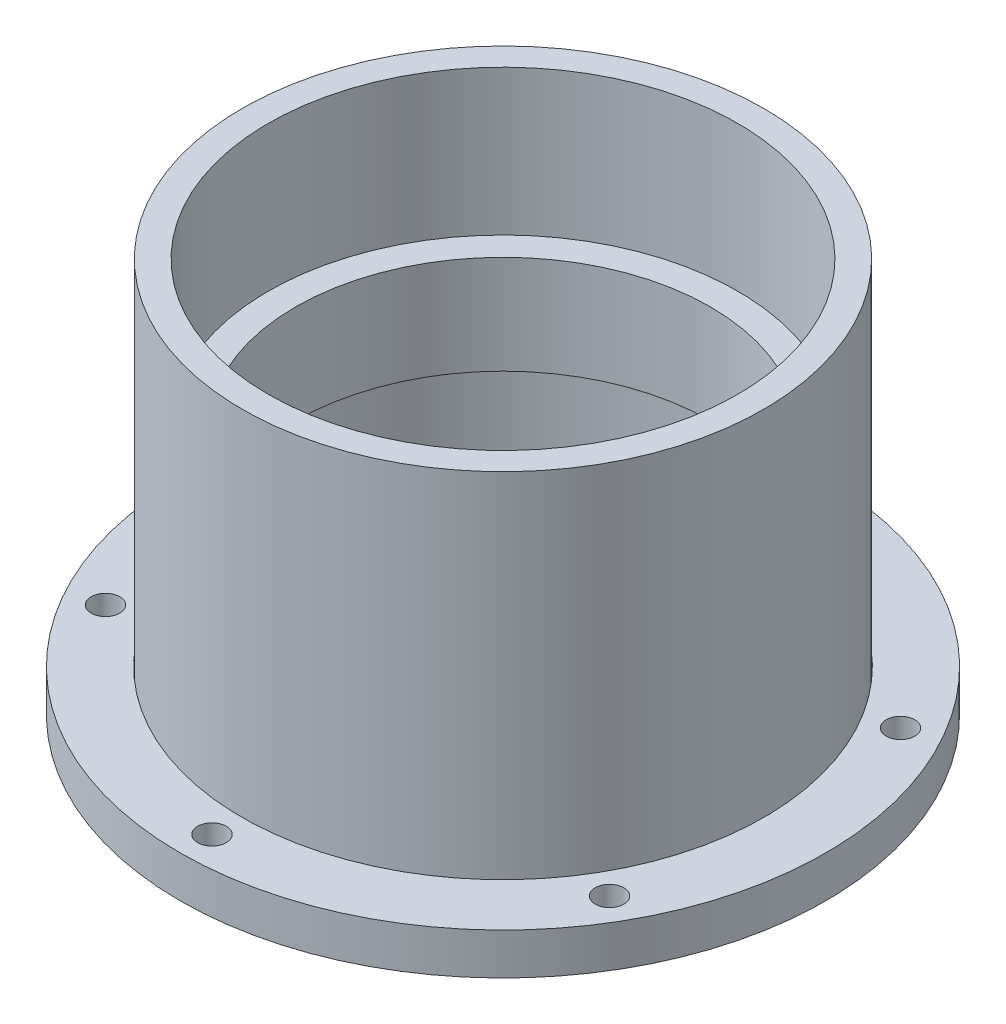
ISO-10303-21;
HEADER;
FILE_DESCRIPTION(('STEP AP214'),'2;1');
FILE_NAME('part.step','',(''),(''),'','','');
FILE_SCHEMA(('AUTOMOTIVE_DESIGN { 1 0 10303 214 1 1 1 1 }'));
ENDSEC;
DATA;
#1=APPLICATION_CONTEXT('core data for automotive mechanical design processes');
#2=APPLICATION_PROTOCOL_DEFINITION('international standard','automotive_design',2000,#1);
#3=PRODUCT_CONTEXT('',#1,'mechanical');
#4=PRODUCT('Part','Part','',(#3));
#5=PRODUCT_RELATED_PRODUCT_CATEGORY('part','',(#4));
#6=PRODUCT_DEFINITION_FORMATION('','',#4);
#7=PRODUCT_DEFINITION_CONTEXT('part definition',#1,'design');
#8=PRODUCT_DEFINITION('design','',#6,#7);
#9=PRODUCT_DEFINITION_SHAPE('','',#8);
#10=(LENGTH_UNIT() NAMED_UNIT(*) SI_UNIT(.MILLI.,.METRE.));
#11=(NAMED_UNIT(*) PLANE_ANGLE_UNIT() SI_UNIT($,.RADIAN.));
#12=(NAMED_UNIT(*) SI_UNIT($,.STERADIAN.) SOLID_ANGLE_UNIT());
#13=UNCERTAINTY_MEASURE_WITH_UNIT(LENGTH_MEASURE(1.E-05),#10,'distance_accuracy_value','');
#14=(GEOMETRIC_REPRESENTATION_CONTEXT(3) GLOBAL_UNCERTAINTY_ASSIGNED_CONTEXT((#13)) GLOBAL_UNIT_ASSIGNED_CONTEXT((#10,
#11,#12)) REPRESENTATION_CONTEXT('',''));
#15=CARTESIAN_POINT('',(0.,0.,0.));
#16=DIRECTION('',(0.,0.,1.));
#17=DIRECTION('',(1.,0.,0.));
#18=AXIS2_PLACEMENT_3D('',#15,#16,#17);
#19=CARTESIAN_POINT('',(0.,7.99999999999998,0.));
#20=DIRECTION('',(0.,-1.,0.));
#21=DIRECTION('',(0.,0.,-1.));
#22=AXIS2_PLACEMENT_3D('',#19,#20,#21);
#23=CYLINDRICAL_SURFACE('',#22,62.2);
#24=CARTESIAN_POINT('',(0.,7.99999999999998,0.));
#25=DIRECTION('',(0.,-1.,0.));
#26=DIRECTION('',(0.,0.,-1.));
#27=AXIS2_PLACEMENT_3D('',#24,#25,#26);
#28=CIRCLE('',#27,62.2);
#29=CARTESIAN_POINT('',(0.,7.99999999999998,-62.2));
#30=VERTEX_POINT('',#29);
#31=EDGE_CURVE('E11',#30,#30,#28,.T.);
#32=ORIENTED_EDGE('',*,*,#31,.T.);
#33=EDGE_LOOP('',(#32));
#34=FACE_BOUND('',#33,.T.);
#35=CARTESIAN_POINT('',(0.,0.,0.));
#36=DIRECTION('',(0.,-1.,0.));
#37=DIRECTION('',(0.,0.,-1.));
#38=AXIS2_PLACEMENT_3D('',#35,#36,#37);
#39=CIRCLE('',#38,62.2);
#40=CARTESIAN_POINT('',(0.,0.,-62.2));
#41=VERTEX_POINT('',#40);
#42=EDGE_CURVE('E50',#41,#41,#39,.T.);
#43=ORIENTED_EDGE('',*,*,#42,.F.);
#44=EDGE_LOOP('',(#43));
#45=FACE_BOUND('',#44,.T.);
#46=ADVANCED_FACE('F47',(#34,#45),#23,.T.);
#47=CARTESIAN_POINT('',(0.,7.99999999999998,0.));
#48=DIRECTION('',(0.,-1.,0.));
#49=DIRECTION('',(0.,0.,-1.));
#50=AXIS2_PLACEMENT_3D('',#47,#48,#49);
#51=PLANE('',#50);
#52=CARTESIAN_POINT('',(3.91464887711092E-13,7.99999999999998,-56.06));
#53=DIRECTION('',(0.,-1.,0.));
#54=DIRECTION('',(0.,0.,-1.));
#55=AXIS2_PLACEMENT_3D('',#52,#53,#54);
#56=CIRCLE('',#55,2.75);
#57=CARTESIAN_POINT('',(3.91464887711092E-13,7.99999999999998,-58.81));
#58=VERTEX_POINT('',#57);
#59=EDGE_CURVE('E92',#58,#58,#56,.T.);
#60=ORIENTED_EDGE('',*,*,#59,.T.);
#61=EDGE_LOOP('',(#60));
#62=FACE_BOUND('',#61,.T.);
#63=CARTESIAN_POINT('',(48.5493841361559,7.99999999999998,-28.0299999999995));
#64=DIRECTION('',(0.,-1.,0.));
#65=DIRECTION('',(0.,0.,-1.));
#66=AXIS2_PLACEMENT_3D('',#63,#64,#65);
#67=CIRCLE('',#66,2.75);
#68=CARTESIAN_POINT('',(48.5493841361559,7.99999999999998,-30.7799999999995));
#69=VERTEX_POINT('',#68);
#70=EDGE_CURVE('E86',#69,#69,#67,.T.);
#71=ORIENTED_EDGE('',*,*,#70,.T.);
#72=EDGE_LOOP('',(#71));
#73=FACE_BOUND('',#72,.T.);
#74=CARTESIAN_POINT('',(48.5493841361553,7.99999999999998,28.0300000000006));
#75=DIRECTION('',(0.,-1.,0.));
#76=DIRECTION('',(0.,0.,-1.));
#77=AXIS2_PLACEMENT_3D('',#74,#75,#76);
#78=CIRCLE('',#77,2.75);
#79=CARTESIAN_POINT('',(48.5493841361553,7.99999999999998,25.2800000000006));
#80=VERTEX_POINT('',#79);
#81=EDGE_CURVE('E80',#80,#80,#78,.T.);
#82=ORIENTED_EDGE('',*,*,#81,.T.);
#83=EDGE_LOOP('',(#82));
#84=FACE_BOUND('',#83,.T.);
#85=CARTESIAN_POINT('',(-48.5493841361555,7.99999999999998,-28.0300000000002));
#86=DIRECTION('',(0.,-1.,0.));
#87=DIRECTION('',(0.,0.,-1.));
#88=AXIS2_PLACEMENT_3D('',#85,#86,#87);
#89=CIRCLE('',#88,2.75);
#90=CARTESIAN_POINT('',(-48.5493841361555,7.99999999999998,-30.7800000000002));
#91=VERTEX_POINT('',#90);
#92=EDGE_CURVE('E74',#91,#91,#89,.T.);
#93=ORIENTED_EDGE('',*,*,#92,.T.);
#94=EDGE_LOOP('',(#93));
#95=FACE_BOUND('',#94,.T.);
#96=CARTESIAN_POINT('',(-48.5493841361557,7.99999999999998,28.0299999999999));
#97=DIRECTION('',(0.,-1.,0.));
#98=DIRECTION('',(0.,0.,-1.));
#99=AXIS2_PLACEMENT_3D('',#96,#97,#98);
#100=CIRCLE('',#99,2.75);
#101=CARTESIAN_POINT('',(-48.5493841361557,7.99999999999998,25.2799999999999));
#102=VERTEX_POINT('',#101);
#103=EDGE_CURVE('E68',#102,#102,#100,.T.);
#104=ORIENTED_EDGE('',*,*,#103,.T.);
#105=EDGE_LOOP('',(#104));
#106=FACE_BOUND('',#105,.T.);
#107=CARTESIAN_POINT('',(0.,7.99999999999998,56.06));
#108=DIRECTION('',(0.,-1.,0.));
#109=DIRECTION('',(0.,0.,-1.));
#110=AXIS2_PLACEMENT_3D('',#107,#108,#109);
#111=CIRCLE('',#110,2.75);
#112=CARTESIAN_POINT('',(0.,7.99999999999998,53.31));
#113=VERTEX_POINT('',#112);
#114=EDGE_CURVE('E62',#113,#113,#111,.T.);
#115=ORIENTED_EDGE('',*,*,#114,.T.);
#116=EDGE_LOOP('',(#115));
#117=FACE_BOUND('',#116,.T.);
#118=CARTESIAN_POINT('',(0.,7.99999999999998,0.));
#119=DIRECTION('',(0.,-1.,0.));
#120=DIRECTION('',(0.,0.,-1.));
#121=AXIS2_PLACEMENT_3D('',#118,#119,#120);
#122=CIRCLE('',#121,50.32);
#123=CARTESIAN_POINT('',(0.,7.99999999999998,-50.32));
#124=VERTEX_POINT('',#123);
#125=EDGE_CURVE('E57',#124,#124,#122,.T.);
#126=ORIENTED_EDGE('',*,*,#125,.T.);
#127=EDGE_LOOP('',(#126));
#128=FACE_BOUND('',#127,.T.);
#129=ORIENTED_EDGE('',*,*,#31,.F.);
#130=EDGE_LOOP('',(#129));
#131=FACE_BOUND('',#130,.T.);
#132=ADVANCED_FACE('F101',(#62,#73,#84,#95,#106,#117,#128,#131),#51,.F.);
#133=CARTESIAN_POINT('',(0.,0.,0.));
#134=DIRECTION('',(0.,-1.,0.));
#135=DIRECTION('',(0.,0.,-1.));
#136=AXIS2_PLACEMENT_3D('',#133,#134,#135);
#137=PLANE('',#136);
#138=CARTESIAN_POINT('',(3.91464887711092E-13,0.,-56.06));
#139=DIRECTION('',(0.,-1.,0.));
#140=DIRECTION('',(0.,0.,-1.));
#141=AXIS2_PLACEMENT_3D('',#138,#139,#140);
#142=CIRCLE('',#141,2.75);
#143=CARTESIAN_POINT('',(3.91464887711092E-13,0.,-58.81));
#144=VERTEX_POINT('',#143);
#145=EDGE_CURVE('E95',#144,#144,#142,.T.);
#146=ORIENTED_EDGE('',*,*,#145,.F.);
#147=EDGE_LOOP('',(#146));
#148=FACE_BOUND('',#147,.T.);
#149=CARTESIAN_POINT('',(48.5493841361559,0.,-28.0299999999995));
#150=DIRECTION('',(0.,-1.,0.));
#151=DIRECTION('',(0.,0.,-1.));
#152=AXIS2_PLACEMENT_3D('',#149,#150,#151);
#153=CIRCLE('',#152,2.75);
#154=CARTESIAN_POINT('',(48.5493841361559,0.,-30.7799999999995));
#155=VERTEX_POINT('',#154);
#156=EDGE_CURVE('E89',#155,#155,#153,.T.);
#157=ORIENTED_EDGE('',*,*,#156,.F.);
#158=EDGE_LOOP('',(#157));
#159=FACE_BOUND('',#158,.T.);
#160=CARTESIAN_POINT('',(48.5493841361553,0.,28.0300000000006));
#161=DIRECTION('',(0.,-1.,0.));
#162=DIRECTION('',(0.,0.,-1.));
#163=AXIS2_PLACEMENT_3D('',#160,#161,#162);
#164=CIRCLE('',#163,2.75);
#165=CARTESIAN_POINT('',(48.5493841361553,0.,25.2800000000006));
#166=VERTEX_POINT('',#165);
#167=EDGE_CURVE('E83',#166,#166,#164,.T.);
#168=ORIENTED_EDGE('',*,*,#167,.F.);
#169=EDGE_LOOP('',(#168));
#170=FACE_BOUND('',#169,.T.);
#171=CARTESIAN_POINT('',(-48.5493841361555,0.,-28.0300000000002));
#172=DIRECTION('',(0.,-1.,0.));
#173=DIRECTION('',(0.,0.,-1.));
#174=AXIS2_PLACEMENT_3D('',#171,#172,#173);
#175=CIRCLE('',#174,2.75);
#176=CARTESIAN_POINT('',(-48.5493841361555,0.,-30.7800000000002));
#177=VERTEX_POINT('',#176);
#178=EDGE_CURVE('E77',#177,#177,#175,.T.);
#179=ORIENTED_EDGE('',*,*,#178,.F.);
#180=EDGE_LOOP('',(#179));
#181=FACE_BOUND('',#180,.T.);
#182=CARTESIAN_POINT('',(-48.5493841361557,0.,28.0299999999999));
#183=DIRECTION('',(0.,-1.,0.));
#184=DIRECTION('',(0.,0.,-1.));
#185=AXIS2_PLACEMENT_3D('',#182,#183,#184);
#186=CIRCLE('',#185,2.75);
#187=CARTESIAN_POINT('',(-48.5493841361557,0.,25.2799999999999));
#188=VERTEX_POINT('',#187);
#189=EDGE_CURVE('E71',#188,#188,#186,.T.);
#190=ORIENTED_EDGE('',*,*,#189,.F.);
#191=EDGE_LOOP('',(#190));
#192=FACE_BOUND('',#191,.T.);
#193=CARTESIAN_POINT('',(0.,0.,56.06));
#194=DIRECTION('',(0.,-1.,0.));
#195=DIRECTION('',(0.,0.,-1.));
#196=AXIS2_PLACEMENT_3D('',#193,#194,#195);
#197=CIRCLE('',#196,2.75);
#198=CARTESIAN_POINT('',(0.,0.,53.31));
#199=VERTEX_POINT('',#198);
#200=EDGE_CURVE('E65',#199,#199,#197,.T.);
#201=ORIENTED_EDGE('',*,*,#200,.F.);
#202=EDGE_LOOP('',(#201));
#203=FACE_BOUND('',#202,.T.);
#204=CARTESIAN_POINT('',(0.,0.,0.));
#205=DIRECTION('',(0.,-1.,0.));
#206=DIRECTION('',(0.,0.,-1.));
#207=AXIS2_PLACEMENT_3D('',#204,#205,#206);
#208=CIRCLE('',#207,50.32);
#209=CARTESIAN_POINT('',(0.,0.,-50.32));
#210=VERTEX_POINT('',#209);
#211=EDGE_CURVE('E59',#210,#210,#208,.T.);
#212=ORIENTED_EDGE('',*,*,#211,.F.);
#213=EDGE_LOOP('',(#212));
#214=FACE_BOUND('',#213,.T.);
#215=ORIENTED_EDGE('',*,*,#42,.T.);
#216=EDGE_LOOP('',(#215));
#217=FACE_BOUND('',#216,.T.);
#218=ADVANCED_FACE('F111',(#148,#159,#170,#181,#192,#203,#214,#217),#137,.T.);
#219=CARTESIAN_POINT('',(0.,7.99999999999998,0.));
#220=DIRECTION('',(0.,-1.,0.));
#221=DIRECTION('',(0.,0.,-1.));
#222=AXIS2_PLACEMENT_3D('',#219,#220,#221);
#223=CYLINDRICAL_SURFACE('',#222,50.32);
#224=ORIENTED_EDGE('',*,*,#125,.F.);
#225=EDGE_LOOP('',(#224));
#226=FACE_BOUND('',#225,.T.);
#227=ORIENTED_EDGE('',*,*,#211,.T.);
#228=EDGE_LOOP('',(#227));
#229=FACE_BOUND('',#228,.T.);
#230=ADVANCED_FACE('F114',(#226,#229),#223,.F.);
#231=CARTESIAN_POINT('',(0.,7.99999999999998,56.06));
#232=DIRECTION('',(0.,-1.,0.));
#233=DIRECTION('',(0.,0.,-1.));
#234=AXIS2_PLACEMENT_3D('',#231,#232,#233);
#235=CYLINDRICAL_SURFACE('',#234,2.75);
#236=ORIENTED_EDGE('',*,*,#114,.F.);
#237=EDGE_LOOP('',(#236));
#238=FACE_BOUND('',#237,.T.);
#239=ORIENTED_EDGE('',*,*,#200,.T.);
#240=EDGE_LOOP('',(#239));
#241=FACE_BOUND('',#240,.T.);
#242=ADVANCED_FACE('F139',(#238,#241),#235,.F.);
#243=CARTESIAN_POINT('',(-48.5493841361557,7.99999999999998,28.0299999999999));
#244=DIRECTION('',(0.,-1.,0.));
#245=DIRECTION('',(0.,0.,-1.));
#246=AXIS2_PLACEMENT_3D('',#243,#244,#245);
#247=CYLINDRICAL_SURFACE('',#246,2.75);
#248=ORIENTED_EDGE('',*,*,#103,.F.);
#249=EDGE_LOOP('',(#248));
#250=FACE_BOUND('',#249,.T.);
#251=ORIENTED_EDGE('',*,*,#189,.T.);
#252=EDGE_LOOP('',(#251));
#253=FACE_BOUND('',#252,.T.);
#254=ADVANCED_FACE('F143',(#250,#253),#247,.F.);
#255=CARTESIAN_POINT('',(-48.5493841361555,7.99999999999998,-28.0300000000002));
#256=DIRECTION('',(0.,-1.,0.));
#257=DIRECTION('',(0.,0.,-1.));
#258=AXIS2_PLACEMENT_3D('',#255,#256,#257);
#259=CYLINDRICAL_SURFACE('',#258,2.75);
#260=ORIENTED_EDGE('',*,*,#92,.F.);
#261=EDGE_LOOP('',(#260));
#262=FACE_BOUND('',#261,.T.);
#263=ORIENTED_EDGE('',*,*,#178,.T.);
#264=EDGE_LOOP('',(#263));
#265=FACE_BOUND('',#264,.T.);
#266=ADVANCED_FACE('F147',(#262,#265),#259,.F.);
#267=CARTESIAN_POINT('',(48.5493841361553,7.99999999999998,28.0300000000006));
#268=DIRECTION('',(0.,-1.,0.));
#269=DIRECTION('',(0.,0.,-1.));
#270=AXIS2_PLACEMENT_3D('',#267,#268,#269);
#271=CYLINDRICAL_SURFACE('',#270,2.75);
#272=ORIENTED_EDGE('',*,*,#81,.F.);
#273=EDGE_LOOP('',(#272));
#274=FACE_BOUND('',#273,.T.);
#275=ORIENTED_EDGE('',*,*,#167,.T.);
#276=EDGE_LOOP('',(#275));
#277=FACE_BOUND('',#276,.T.);
#278=ADVANCED_FACE('F151',(#274,#277),#271,.F.);
#279=CARTESIAN_POINT('',(48.5493841361559,7.99999999999998,-28.0299999999995));
#280=DIRECTION('',(0.,-1.,0.));
#281=DIRECTION('',(0.,0.,-1.));
#282=AXIS2_PLACEMENT_3D('',#279,#280,#281);
#283=CYLINDRICAL_SURFACE('',#282,2.75);
#284=ORIENTED_EDGE('',*,*,#70,.F.);
#285=EDGE_LOOP('',(#284));
#286=FACE_BOUND('',#285,.T.);
#287=ORIENTED_EDGE('',*,*,#156,.T.);
#288=EDGE_LOOP('',(#287));
#289=FACE_BOUND('',#288,.T.);
#290=ADVANCED_FACE('F107',(#286,#289),#283,.F.);
#291=CARTESIAN_POINT('',(3.91464887711092E-13,7.99999999999998,-56.06));
#292=DIRECTION('',(0.,-1.,0.));
#293=DIRECTION('',(0.,0.,-1.));
#294=AXIS2_PLACEMENT_3D('',#291,#292,#293);
#295=CYLINDRICAL_SURFACE('',#294,2.75);
#296=ORIENTED_EDGE('',*,*,#59,.F.);
#297=EDGE_LOOP('',(#296));
#298=FACE_BOUND('',#297,.T.);
#299=ORIENTED_EDGE('',*,*,#145,.T.);
#300=EDGE_LOOP('',(#299));
#301=FACE_BOUND('',#300,.T.);
#302=ADVANCED_FACE('F104',(#298,#301),#295,.F.);
#303=CLOSED_SHELL('',(#46,#132,#218,#230,#242,#254,#266,#278,#290,#302));
#304=MANIFOLD_SOLID_BREP('B2',#303);
#305=CARTESIAN_POINT('',(0.,48.,0.));
#306=DIRECTION('',(0.,1.,0.));
#307=DIRECTION('',(0.,0.,1.));
#308=AXIS2_PLACEMENT_3D('',#305,#306,#307);
#309=PLANE('',#308);
#310=CARTESIAN_POINT('',(0.,48.,0.));
#311=DIRECTION('',(0.,1.,0.));
#312=DIRECTION('',(0.,0.,1.));
#313=AXIS2_PLACEMENT_3D('',#310,#311,#312);
#314=CIRCLE('',#313,39.97);
#315=CARTESIAN_POINT('',(0.,48.,39.97));
#316=VERTEX_POINT('',#315);
#317=EDGE_CURVE('E250',#316,#316,#314,.T.);
#318=ORIENTED_EDGE('',*,*,#317,.F.);
#319=EDGE_LOOP('',(#318));
#320=FACE_BOUND('',#319,.T.);
#321=CARTESIAN_POINT('',(0.,48.,0.));
#322=DIRECTION('',(0.,1.,0.));
#323=DIRECTION('',(0.,0.,1.));
#324=AXIS2_PLACEMENT_3D('',#321,#322,#323);
#325=CIRCLE('',#324,45.22);
#326=CARTESIAN_POINT('',(0.,48.,45.22));
#327=VERTEX_POINT('',#326);
#328=EDGE_CURVE('E262',#327,#327,#325,.T.);
#329=ORIENTED_EDGE('',*,*,#328,.T.);
#330=EDGE_LOOP('',(#329));
#331=FACE_BOUND('',#330,.T.);
#332=ADVANCED_FACE('F235',(#320,#331),#309,.T.);
#333=CARTESIAN_POINT('',(0.,0.,0.));
#334=DIRECTION('',(0.,1.,0.));
#335=DIRECTION('',(0.,0.,1.));
#336=AXIS2_PLACEMENT_3D('',#333,#334,#335);
#337=PLANE('',#336);
#338=CARTESIAN_POINT('',(0.,0.,0.));
#339=DIRECTION('',(0.,1.,0.));
#340=DIRECTION('',(0.,0.,1.));
#341=AXIS2_PLACEMENT_3D('',#338,#339,#340);
#342=CIRCLE('',#341,50.22);
#343=CARTESIAN_POINT('',(0.,0.,-50.22));
#344=VERTEX_POINT('',#343);
#345=EDGE_CURVE('E46',#344,#344,#342,.T.);
#346=ORIENTED_EDGE('',*,*,#345,.F.);
#347=EDGE_LOOP('',(#346));
#348=FACE_BOUND('',#347,.T.);
#349=CARTESIAN_POINT('',(0.,0.,0.));
#350=DIRECTION('',(0.,1.,0.));
#351=DIRECTION('',(0.,0.,1.));
#352=AXIS2_PLACEMENT_3D('',#349,#350,#351);
#353=CIRCLE('',#352,45.22);
#354=CARTESIAN_POINT('',(0.,0.,-45.22));
#355=VERTEX_POINT('',#354);
#356=EDGE_CURVE('E242',#355,#355,#353,.T.);
#357=ORIENTED_EDGE('',*,*,#356,.T.);
#358=EDGE_LOOP('',(#357));
#359=FACE_BOUND('',#358,.T.);
#360=ADVANCED_FACE('F287',(#348,#359),#337,.F.);
#361=CARTESIAN_POINT('',(0.,29.,0.));
#362=DIRECTION('',(0.,-1.,0.));
#363=DIRECTION('',(0.,0.,-1.));
#364=AXIS2_PLACEMENT_3D('',#361,#362,#363);
#365=CYLINDRICAL_SURFACE('',#364,50.22);
#366=CARTESIAN_POINT('',(0.,76.,0.));
#367=DIRECTION('',(0.,1.,0.));
#368=DIRECTION('',(0.,0.,1.));
#369=AXIS2_PLACEMENT_3D('',#366,#367,#368);
#370=CIRCLE('',#369,50.22);
#371=CARTESIAN_POINT('',(0.,76.,-50.22));
#372=VERTEX_POINT('',#371);
#373=EDGE_CURVE('E256',#372,#372,#370,.T.);
#374=CARTESIAN_POINT('',(0.,0.,-50.22));
#375=CARTESIAN_POINT('',(0.,0.791666666666669,-50.22));
#376=CARTESIAN_POINT('',(0.,1.58333333333334,-50.22));
#377=CARTESIAN_POINT('',(0.,3.16666666666667,-50.22));
#378=CARTESIAN_POINT('',(0.,3.95833333333333,-50.22));
#379=CARTESIAN_POINT('',(0.,5.54166666666667,-50.22));
#380=CARTESIAN_POINT('',(0.,6.33333333333333,-50.22));
#381=CARTESIAN_POINT('',(0.,7.91666666666667,-50.22));
#382=CARTESIAN_POINT('',(0.,8.70833333333333,-50.22));
#383=CARTESIAN_POINT('',(0.,10.2916666666667,-50.22));
#384=CARTESIAN_POINT('',(0.,11.0833333333333,-50.22));
#385=CARTESIAN_POINT('',(0.,12.6666666666667,-50.22));
#386=CARTESIAN_POINT('',(0.,13.4583333333333,-50.22));
#387=CARTESIAN_POINT('',(0.,15.0416666666667,-50.22));
#388=CARTESIAN_POINT('',(0.,15.8333333333333,-50.22));
#389=CARTESIAN_POINT('',(0.,17.4166666666667,-50.22));
#390=CARTESIAN_POINT('',(0.,18.2083333333333,-50.22));
#391=CARTESIAN_POINT('',(0.,19.7916666666667,-50.22));
#392=CARTESIAN_POINT('',(0.,20.5833333333333,-50.22));
#393=CARTESIAN_POINT('',(0.,22.1666666666667,-50.22));
#394=CARTESIAN_POINT('',(0.,22.9583333333333,-50.22));
#395=CARTESIAN_POINT('',(0.,24.5416666666667,-50.22));
#396=CARTESIAN_POINT('',(0.,25.3333333333333,-50.22));
#397=CARTESIAN_POINT('',(0.,26.9166666666667,-50.22));
#398=CARTESIAN_POINT('',(0.,27.7083333333333,-50.22));
#399=CARTESIAN_POINT('',(0.,29.2916666666667,-50.22));
#400=CARTESIAN_POINT('',(0.,30.0833333333333,-50.22));
#401=CARTESIAN_POINT('',(0.,31.6666666666667,-50.22));
#402=CARTESIAN_POINT('',(0.,32.4583333333333,-50.22));
#403=CARTESIAN_POINT('',(0.,34.0416666666667,-50.22));
#404=CARTESIAN_POINT('',(0.,34.8333333333333,-50.22));
#405=CARTESIAN_POINT('',(0.,36.4166666666667,-50.22));
#406=CARTESIAN_POINT('',(0.,37.2083333333333,-50.22));
#407=CARTESIAN_POINT('',(0.,38.7916666666667,-50.22));
#408=CARTESIAN_POINT('',(0.,39.5833333333333,-50.22));
#409=CARTESIAN_POINT('',(0.,41.1666666666667,-50.22));
#410=CARTESIAN_POINT('',(0.,41.9583333333333,-50.22));
#411=CARTESIAN_POINT('',(0.,43.5416666666667,-50.22));
#412=CARTESIAN_POINT('',(0.,44.3333333333333,-50.22));
#413=CARTESIAN_POINT('',(0.,45.9166666666667,-50.22));
#414=CARTESIAN_POINT('',(0.,46.7083333333333,-50.22));
#415=CARTESIAN_POINT('',(0.,48.2916666666667,-50.22));
#416=CARTESIAN_POINT('',(0.,49.0833333333333,-50.22));
#417=CARTESIAN_POINT('',(0.,50.6666666666667,-50.22));
#418=CARTESIAN_POINT('',(0.,51.4583333333333,-50.22));
#419=CARTESIAN_POINT('',(0.,53.0416666666667,-50.22));
#420=CARTESIAN_POINT('',(0.,53.8333333333333,-50.22));
#421=CARTESIAN_POINT('',(0.,55.4166666666667,-50.22));
#422=CARTESIAN_POINT('',(0.,56.2083333333333,-50.22));
#423=CARTESIAN_POINT('',(0.,57.7916666666667,-50.22));
#424=CARTESIAN_POINT('',(0.,58.5833333333333,-50.22));
#425=CARTESIAN_POINT('',(0.,60.1666666666667,-50.22));
#426=CARTESIAN_POINT('',(0.,60.9583333333333,-50.22));
#427=CARTESIAN_POINT('',(0.,62.5416666666667,-50.22));
#428=CARTESIAN_POINT('',(0.,63.3333333333333,-50.22));
#429=CARTESIAN_POINT('',(0.,64.9166666666667,-50.22));
#430=CARTESIAN_POINT('',(0.,65.7083333333333,-50.22));
#431=CARTESIAN_POINT('',(0.,67.2916666666667,-50.22));
#432=CARTESIAN_POINT('',(0.,68.0833333333333,-50.22));
#433=CARTESIAN_POINT('',(0.,69.6666666666667,-50.22));
#434=CARTESIAN_POINT('',(0.,70.4583333333333,-50.22));
#435=CARTESIAN_POINT('',(0.,72.0416666666667,-50.22));
#436=CARTESIAN_POINT('',(0.,72.8333333333333,-50.22));
#437=CARTESIAN_POINT('',(0.,74.4166666666667,-50.22));
#438=CARTESIAN_POINT('',(0.,75.2083333333333,-50.22));
#439=CARTESIAN_POINT('',(0.,76.,-50.22));
#440=B_SPLINE_CURVE_WITH_KNOTS('',3,(#374,#375,#376,#377,#378,#379,#380,#381,#382,#383,#384,
#385,#386,#387,#388,#389,#390,#391,#392,#393,#394,#395,#396,#397,#398,#399,#400,#401,#402,#403,
#404,#405,#406,#407,#408,#409,#410,#411,#412,#413,#414,#415,#416,#417,#418,#419,#420,#421,#422,
#423,#424,#425,#426,#427,#428,#429,#430,#431,#432,#433,#434,#435,#436,#437,#438,#439),
.UNSPECIFIED.,.F.,.F.,(4,2,2,2,2,2,2,2,2,2,2,2,2,2,2,2,2,2,2,2,2,2,2,2,2,2,2,2,2,2,2,2,4),(0.,
2.375,4.75,7.125,9.5,11.875,14.25,16.625,19.,21.375,23.75,26.125,28.5,30.875,33.25,35.625,38.,
40.375,42.75,45.125,47.5,49.875,52.25,54.625,57.,59.375,61.75,64.125,66.5,68.875,71.25,73.625,
76.),.UNSPECIFIED.);
#441=EDGE_CURVE('BSEAM237',#344,#372,#440,.T.);
#442=ORIENTED_EDGE('',*,*,#345,.T.);
#443=ORIENTED_EDGE('',*,*,#373,.F.);
#444=ORIENTED_EDGE('',*,*,#441,.T.);
#445=ORIENTED_EDGE('',*,*,#441,.F.);
#446=EDGE_LOOP('',(#442,#444,#443,#445));
#447=FACE_BOUND('',#446,.T.);
#448=ADVANCED_FACE('F237',(#447),#365,.T.);
#449=CARTESIAN_POINT('',(0.,29.,0.));
#450=DIRECTION('',(0.,-1.,0.));
#451=DIRECTION('',(0.,0.,-1.));
#452=AXIS2_PLACEMENT_3D('',#449,#450,#451);
#453=CYLINDRICAL_SURFACE('',#452,45.22);
#454=CARTESIAN_POINT('',(0.,29.,0.));
#455=DIRECTION('',(0.,1.,0.));
#456=DIRECTION('',(0.,0.,1.));
#457=AXIS2_PLACEMENT_3D('',#454,#455,#456);
#458=CIRCLE('',#457,45.22);
#459=CARTESIAN_POINT('',(0.,29.,-45.22));
#460=VERTEX_POINT('',#459);
#461=EDGE_CURVE('E246',#460,#460,#458,.T.);
#462=CARTESIAN_POINT('',(0.,29.,-45.22));
#463=CARTESIAN_POINT('',(0.,28.6979166666667,-45.22));
#464=CARTESIAN_POINT('',(0.,28.3958333333333,-45.22));
#465=CARTESIAN_POINT('',(0.,27.7916666666667,-45.22));
#466=CARTESIAN_POINT('',(0.,27.4895833333333,-45.22));
#467=CARTESIAN_POINT('',(0.,26.8854166666667,-45.22));
#468=CARTESIAN_POINT('',(0.,26.5833333333333,-45.22));
#469=CARTESIAN_POINT('',(0.,25.9791666666667,-45.22));
#470=CARTESIAN_POINT('',(0.,25.6770833333333,-45.22));
#471=CARTESIAN_POINT('',(0.,25.0729166666667,-45.22));
#472=CARTESIAN_POINT('',(0.,24.7708333333333,-45.22));
#473=CARTESIAN_POINT('',(0.,24.1666666666667,-45.22));
#474=CARTESIAN_POINT('',(0.,23.8645833333333,-45.22));
#475=CARTESIAN_POINT('',(0.,23.2604166666667,-45.22));
#476=CARTESIAN_POINT('',(0.,22.9583333333333,-45.22));
#477=CARTESIAN_POINT('',(0.,22.3541666666667,-45.22));
#478=CARTESIAN_POINT('',(0.,22.0520833333333,-45.22));
#479=CARTESIAN_POINT('',(0.,21.4479166666667,-45.22));
#480=CARTESIAN_POINT('',(0.,21.1458333333333,-45.22));
#481=CARTESIAN_POINT('',(0.,20.5416666666667,-45.22));
#482=CARTESIAN_POINT('',(0.,20.2395833333333,-45.22));
#483=CARTESIAN_POINT('',(0.,19.6354166666667,-45.22));
#484=CARTESIAN_POINT('',(0.,19.3333333333333,-45.22));
#485=CARTESIAN_POINT('',(0.,18.7291666666667,-45.22));
#486=CARTESIAN_POINT('',(0.,18.4270833333333,-45.22));
#487=CARTESIAN_POINT('',(0.,17.8229166666667,-45.22));
#488=CARTESIAN_POINT('',(0.,17.5208333333333,-45.22));
#489=CARTESIAN_POINT('',(0.,16.9166666666667,-45.22));
#490=CARTESIAN_POINT('',(0.,16.6145833333333,-45.22));
#491=CARTESIAN_POINT('',(0.,16.0104166666667,-45.22));
#492=CARTESIAN_POINT('',(0.,15.7083333333333,-45.22));
#493=CARTESIAN_POINT('',(0.,15.1041666666667,-45.22));
#494=CARTESIAN_POINT('',(0.,14.8020833333333,-45.22));
#495=CARTESIAN_POINT('',(0.,14.1979166666667,-45.22));
#496=CARTESIAN_POINT('',(0.,13.8958333333333,-45.22));
#497=CARTESIAN_POINT('',(0.,13.2916666666667,-45.22));
#498=CARTESIAN_POINT('',(0.,12.9895833333333,-45.22));
#499=CARTESIAN_POINT('',(0.,12.3854166666667,-45.22));
#500=CARTESIAN_POINT('',(0.,12.0833333333333,-45.22));
#501=CARTESIAN_POINT('',(0.,11.4791666666667,-45.22));
#502=CARTESIAN_POINT('',(0.,11.1770833333333,-45.22));
#503=CARTESIAN_POINT('',(0.,10.5729166666667,-45.22));
#504=CARTESIAN_POINT('',(0.,10.2708333333333,-45.22));
#505=CARTESIAN_POINT('',(0.,9.66666666666667,-45.22));
#506=CARTESIAN_POINT('',(0.,9.36458333333333,-45.22));
#507=CARTESIAN_POINT('',(0.,8.76041666666667,-45.22));
#508=CARTESIAN_POINT('',(0.,8.45833333333333,-45.22));
#509=CARTESIAN_POINT('',(0.,7.85416666666667,-45.22));
#510=CARTESIAN_POINT('',(0.,7.55208333333333,-45.22));
#511=CARTESIAN_POINT('',(0.,6.94791666666667,-45.22));
#512=CARTESIAN_POINT('',(0.,6.64583333333333,-45.22));
#513=CARTESIAN_POINT('',(0.,6.04166666666667,-45.22));
#514=CARTESIAN_POINT('',(0.,5.73958333333333,-45.22));
#515=CARTESIAN_POINT('',(0.,5.13541666666667,-45.22));
#516=CARTESIAN_POINT('',(0.,4.83333333333333,-45.22));
#517=CARTESIAN_POINT('',(0.,4.22916666666667,-45.22));
#518=CARTESIAN_POINT('',(0.,3.92708333333333,-45.22));
#519=CARTESIAN_POINT('',(0.,3.32291666666667,-45.22));
#520=CARTESIAN_POINT('',(0.,3.02083333333333,-45.22));
#521=CARTESIAN_POINT('',(0.,2.41666666666667,-45.22));
#522=CARTESIAN_POINT('',(0.,2.11458333333333,-45.22));
#523=CARTESIAN_POINT('',(0.,1.51041666666667,-45.22));
#524=CARTESIAN_POINT('',(0.,1.20833333333333,-45.22));
#525=CARTESIAN_POINT('',(0.,0.604166666666667,-45.22));
#526=CARTESIAN_POINT('',(0.,0.302083333333333,-45.22));
#527=CARTESIAN_POINT('',(0.,0.,-45.22));
#528=B_SPLINE_CURVE_WITH_KNOTS('',3,(#462,#463,#464,#465,#466,#467,#468,#469,#470,#471,#472,
#473,#474,#475,#476,#477,#478,#479,#480,#481,#482,#483,#484,#485,#486,#487,#488,#489,#490,#491,
#492,#493,#494,#495,#496,#497,#498,#499,#500,#501,#502,#503,#504,#505,#506,#507,#508,#509,#510,
#511,#512,#513,#514,#515,#516,#517,#518,#519,#520,#521,#522,#523,#524,#525,#526,#527),
.UNSPECIFIED.,.F.,.F.,(4,2,2,2,2,2,2,2,2,2,2,2,2,2,2,2,2,2,2,2,2,2,2,2,2,2,2,2,2,2,2,2,4),(0.,
0.906249999999997,1.8125,2.71875,3.625,4.53125,5.4375,6.34375,7.25,8.15625,9.0625,9.96875,
10.875,11.78125,12.6875,13.59375,14.5,15.40625,16.3125,17.21875,18.125,19.03125,19.9375,
20.84375,21.75,22.65625,23.5625,24.46875,25.375,26.28125,27.1875,28.09375,29.),.UNSPECIFIED.);
#529=EDGE_CURVE('BSEAM297',#460,#355,#528,.T.);
#530=ORIENTED_EDGE('',*,*,#461,.T.);
#531=ORIENTED_EDGE('',*,*,#356,.F.);
#532=ORIENTED_EDGE('',*,*,#529,.T.);
#533=ORIENTED_EDGE('',*,*,#529,.F.);
#534=EDGE_LOOP('',(#530,#532,#531,#533));
#535=FACE_BOUND('',#534,.T.);
#536=ADVANCED_FACE('F297',(#535),#453,.F.);
#537=CARTESIAN_POINT('',(0.,29.,0.));
#538=DIRECTION('',(0.,1.,0.));
#539=DIRECTION('',(0.,0.,1.));
#540=AXIS2_PLACEMENT_3D('',#537,#538,#539);
#541=PLANE('',#540);
#542=CARTESIAN_POINT('',(0.,29.,0.));
#543=DIRECTION('',(0.,1.,0.));
#544=DIRECTION('',(0.,0.,1.));
#545=AXIS2_PLACEMENT_3D('',#542,#543,#544);
#546=CIRCLE('',#545,39.97);
#547=CARTESIAN_POINT('',(0.,29.,39.97));
#548=VERTEX_POINT('',#547);
#549=EDGE_CURVE('E253',#548,#548,#546,.T.);
#550=ORIENTED_EDGE('',*,*,#549,.T.);
#551=EDGE_LOOP('',(#550));
#552=FACE_BOUND('',#551,.T.);
#553=ORIENTED_EDGE('',*,*,#461,.F.);
#554=EDGE_LOOP('',(#553));
#555=FACE_BOUND('',#554,.T.);
#556=ADVANCED_FACE('F282',(#552,#555),#541,.F.);
#557=CARTESIAN_POINT('',(0.,48.,0.));
#558=DIRECTION('',(0.,-1.,0.));
#559=DIRECTION('',(0.,0.,-1.));
#560=AXIS2_PLACEMENT_3D('',#557,#558,#559);
#561=CYLINDRICAL_SURFACE('',#560,39.97);
#562=ORIENTED_EDGE('',*,*,#317,.T.);
#563=EDGE_LOOP('',(#562));
#564=FACE_BOUND('',#563,.T.);
#565=ORIENTED_EDGE('',*,*,#549,.F.);
#566=EDGE_LOOP('',(#565));
#567=FACE_BOUND('',#566,.T.);
#568=ADVANCED_FACE('F273',(#564,#567),#561,.F.);
#569=CARTESIAN_POINT('',(0.,76.,0.));
#570=DIRECTION('',(0.,1.,0.));
#571=DIRECTION('',(0.,0.,1.));
#572=AXIS2_PLACEMENT_3D('',#569,#570,#571);
#573=PLANE('',#572);
#574=ORIENTED_EDGE('',*,*,#373,.T.);
#575=EDGE_LOOP('',(#574));
#576=FACE_BOUND('',#575,.T.);
#577=CARTESIAN_POINT('',(0.,76.,0.));
#578=DIRECTION('',(0.,1.,0.));
#579=DIRECTION('',(0.,0.,1.));
#580=AXIS2_PLACEMENT_3D('',#577,#578,#579);
#581=CIRCLE('',#580,45.22);
#582=CARTESIAN_POINT('',(0.,76.,45.22));
#583=VERTEX_POINT('',#582);
#584=EDGE_CURVE('E261',#583,#583,#581,.T.);
#585=ORIENTED_EDGE('',*,*,#584,.F.);
#586=EDGE_LOOP('',(#585));
#587=FACE_BOUND('',#586,.T.);
#588=ADVANCED_FACE('F271',(#576,#587),#573,.T.);
#589=CARTESIAN_POINT('',(0.,76.,0.));
#590=DIRECTION('',(0.,-1.,0.));
#591=DIRECTION('',(0.,0.,-1.));
#592=AXIS2_PLACEMENT_3D('',#589,#590,#591);
#593=CYLINDRICAL_SURFACE('',#592,45.22);
#594=ORIENTED_EDGE('',*,*,#584,.T.);
#595=EDGE_LOOP('',(#594));
#596=FACE_BOUND('',#595,.T.);
#597=ORIENTED_EDGE('',*,*,#328,.F.);
#598=EDGE_LOOP('',(#597));
#599=FACE_BOUND('',#598,.T.);
#600=ADVANCED_FACE('F268',(#596,#599),#593,.F.);
#601=CLOSED_SHELL('',(#332,#360,#448,#536,#556,#568,#588,#600));
#602=MANIFOLD_SOLID_BREP('B6',#601);
#603=ADVANCED_BREP_SHAPE_REPRESENTATION('',(#18,#304,#602),#14);
#604=SHAPE_DEFINITION_REPRESENTATION(#9,#603);
ENDSEC;
END-ISO-10303-21;
